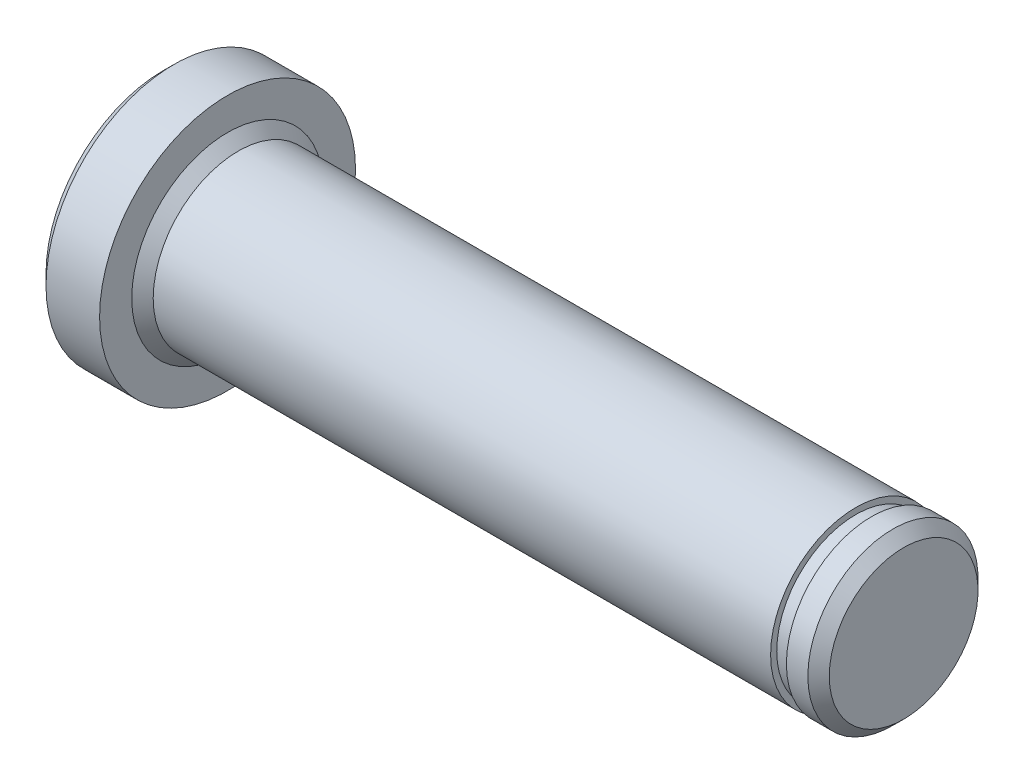
ISO-10303-21;
HEADER;
FILE_DESCRIPTION(('STEP AP214'),'2;1');
FILE_NAME('part.step','',(''),(''),'','','');
FILE_SCHEMA(('AUTOMOTIVE_DESIGN { 1 0 10303 214 1 1 1 1 }'));
ENDSEC;
DATA;
#1=APPLICATION_CONTEXT('core data for automotive mechanical design processes');
#2=APPLICATION_PROTOCOL_DEFINITION('international standard','automotive_design',2000,#1);
#3=PRODUCT_CONTEXT('',#1,'mechanical');
#4=PRODUCT('Part','Part','',(#3));
#5=PRODUCT_RELATED_PRODUCT_CATEGORY('part','',(#4));
#6=PRODUCT_DEFINITION_FORMATION('','',#4);
#7=PRODUCT_DEFINITION_CONTEXT('part definition',#1,'design');
#8=PRODUCT_DEFINITION('design','',#6,#7);
#9=PRODUCT_DEFINITION_SHAPE('','',#8);
#10=(LENGTH_UNIT() NAMED_UNIT(*) SI_UNIT(.MILLI.,.METRE.));
#11=(NAMED_UNIT(*) PLANE_ANGLE_UNIT() SI_UNIT($,.RADIAN.));
#12=(NAMED_UNIT(*) SI_UNIT($,.STERADIAN.) SOLID_ANGLE_UNIT());
#13=UNCERTAINTY_MEASURE_WITH_UNIT(LENGTH_MEASURE(1.E-05),#10,'distance_accuracy_value','');
#14=(GEOMETRIC_REPRESENTATION_CONTEXT(3) GLOBAL_UNCERTAINTY_ASSIGNED_CONTEXT((#13)) GLOBAL_UNIT_ASSIGNED_CONTEXT((#10,
#11,#12)) REPRESENTATION_CONTEXT('',''));
#15=CARTESIAN_POINT('',(0.,0.,0.));
#16=DIRECTION('',(0.,0.,1.));
#17=DIRECTION('',(1.,0.,0.));
#18=AXIS2_PLACEMENT_3D('',#15,#16,#17);
#19=CARTESIAN_POINT('',(-20.1990828492571,0.,0.));
#20=DIRECTION('',(-1.,0.,0.));
#21=DIRECTION('',(0.,0.,1.));
#22=AXIS2_PLACEMENT_3D('',#19,#20,#21);
#23=CYLINDRICAL_SURFACE('',#22,3.96875);
#24=CARTESIAN_POINT('',(0.499999999999994,0.,0.));
#25=DIRECTION('',(-1.,0.,0.));
#26=DIRECTION('',(0.,0.,1.));
#27=AXIS2_PLACEMENT_3D('',#24,#25,#26);
#28=CIRCLE('',#27,3.96875);
#29=CARTESIAN_POINT('',(0.499999999999994,0.,3.96875));
#30=VERTEX_POINT('',#29);
#31=EDGE_CURVE('E52',#30,#30,#28,.F.);
#32=ORIENTED_EDGE('',*,*,#31,.T.);
#33=EDGE_LOOP('',(#32));
#34=FACE_BOUND('',#33,.T.);
#35=CARTESIAN_POINT('',(29.3,0.,0.));
#36=DIRECTION('',(-1.,0.,0.));
#37=DIRECTION('',(0.,0.,1.));
#38=AXIS2_PLACEMENT_3D('',#35,#36,#37);
#39=CIRCLE('',#38,3.96875);
#40=CARTESIAN_POINT('',(29.3,0.,3.96875));
#41=VERTEX_POINT('',#40);
#42=EDGE_CURVE('E58',#41,#41,#39,.T.);
#43=ORIENTED_EDGE('',*,*,#42,.T.);
#44=EDGE_LOOP('',(#43));
#45=FACE_BOUND('',#44,.T.);
#46=ADVANCED_FACE('F32',(#34,#45),#23,.T.);
#47=CARTESIAN_POINT('',(29.3,3.96875000000002,0.));
#48=DIRECTION('',(-1.,0.,0.));
#49=DIRECTION('',(0.,0.,1.));
#50=AXIS2_PLACEMENT_3D('',#47,#48,#49);
#51=PLANE('',#50);
#52=ORIENTED_EDGE('',*,*,#42,.F.);
#53=EDGE_LOOP('',(#52));
#54=FACE_BOUND('',#53,.T.);
#55=CARTESIAN_POINT('',(29.3,0.,0.));
#56=DIRECTION('',(-1.,0.,0.));
#57=DIRECTION('',(0.,0.,1.));
#58=AXIS2_PLACEMENT_3D('',#55,#56,#57);
#59=CIRCLE('',#58,3.683);
#60=CARTESIAN_POINT('',(29.3,0.,3.683));
#61=VERTEX_POINT('',#60);
#62=EDGE_CURVE('E61',#61,#61,#59,.T.);
#63=ORIENTED_EDGE('',*,*,#62,.T.);
#64=EDGE_LOOP('',(#63));
#65=FACE_BOUND('',#64,.T.);
#66=ADVANCED_FACE('F92',(#54,#65),#51,.F.);
#67=CARTESIAN_POINT('',(-20.1990828492571,0.,0.));
#68=DIRECTION('',(-1.,0.,0.));
#69=DIRECTION('',(0.,0.,1.));
#70=AXIS2_PLACEMENT_3D('',#67,#68,#69);
#71=CYLINDRICAL_SURFACE('',#70,3.683);
#72=ORIENTED_EDGE('',*,*,#62,.F.);
#73=EDGE_LOOP('',(#72));
#74=FACE_BOUND('',#73,.T.);
#75=CARTESIAN_POINT('',(30.0366,0.,0.));
#76=DIRECTION('',(-1.,0.,0.));
#77=DIRECTION('',(0.,0.,1.));
#78=AXIS2_PLACEMENT_3D('',#75,#76,#77);
#79=CIRCLE('',#78,3.683);
#80=CARTESIAN_POINT('',(30.0366,0.,3.683));
#81=VERTEX_POINT('',#80);
#82=EDGE_CURVE('E64',#81,#81,#79,.T.);
#83=ORIENTED_EDGE('',*,*,#82,.T.);
#84=EDGE_LOOP('',(#83));
#85=FACE_BOUND('',#84,.T.);
#86=ADVANCED_FACE('F98',(#74,#85),#71,.T.);
#87=CARTESIAN_POINT('',(30.0366,3.68299999999999,0.));
#88=DIRECTION('',(1.,0.,0.));
#89=DIRECTION('',(0.,0.,-1.));
#90=AXIS2_PLACEMENT_3D('',#87,#88,#89);
#91=PLANE('',#90);
#92=ORIENTED_EDGE('',*,*,#82,.F.);
#93=EDGE_LOOP('',(#92));
#94=FACE_BOUND('',#93,.T.);
#95=CARTESIAN_POINT('',(30.0366,0.,0.));
#96=DIRECTION('',(-1.,0.,0.));
#97=DIRECTION('',(0.,0.,1.));
#98=AXIS2_PLACEMENT_3D('',#95,#96,#97);
#99=CIRCLE('',#98,3.96875);
#100=CARTESIAN_POINT('',(30.0366,0.,3.96875));
#101=VERTEX_POINT('',#100);
#102=EDGE_CURVE('E67',#101,#101,#99,.T.);
#103=ORIENTED_EDGE('',*,*,#102,.T.);
#104=EDGE_LOOP('',(#103));
#105=FACE_BOUND('',#104,.T.);
#106=ADVANCED_FACE('F124',(#94,#105),#91,.F.);
#107=CARTESIAN_POINT('',(-20.1990828492571,0.,0.));
#108=DIRECTION('',(-1.,0.,0.));
#109=DIRECTION('',(0.,0.,1.));
#110=AXIS2_PLACEMENT_3D('',#107,#108,#109);
#111=CYLINDRICAL_SURFACE('',#110,3.96875);
#112=CARTESIAN_POINT('',(31.0366,0.,0.));
#113=DIRECTION('',(-1.,0.,0.));
#114=DIRECTION('',(0.,0.,1.));
#115=AXIS2_PLACEMENT_3D('',#112,#113,#114);
#116=CIRCLE('',#115,3.96875);
#117=CARTESIAN_POINT('',(31.0366,0.,3.96875));
#118=VERTEX_POINT('',#117);
#119=EDGE_CURVE('E39',#118,#118,#116,.T.);
#120=ORIENTED_EDGE('',*,*,#119,.T.);
#121=EDGE_LOOP('',(#120));
#122=FACE_BOUND('',#121,.T.);
#123=ORIENTED_EDGE('',*,*,#102,.F.);
#124=EDGE_LOOP('',(#123));
#125=FACE_BOUND('',#124,.T.);
#126=ADVANCED_FACE('F119',(#122,#125),#111,.T.);
#127=CARTESIAN_POINT('',(31.5366,3.96875000000002,0.));
#128=DIRECTION('',(-1.,0.,0.));
#129=DIRECTION('',(0.,0.,1.));
#130=AXIS2_PLACEMENT_3D('',#127,#128,#129);
#131=PLANE('',#130);
#132=CARTESIAN_POINT('',(31.5366,0.,0.));
#133=DIRECTION('',(-1.,0.,0.));
#134=DIRECTION('',(0.,0.,1.));
#135=AXIS2_PLACEMENT_3D('',#132,#133,#134);
#136=CIRCLE('',#135,3.46874999999999);
#137=CARTESIAN_POINT('',(31.5366,0.,3.46874999999999));
#138=VERTEX_POINT('',#137);
#139=EDGE_CURVE('E10',#138,#138,#136,.F.);
#140=ORIENTED_EDGE('',*,*,#139,.T.);
#141=EDGE_LOOP('',(#140));
#142=FACE_BOUND('',#141,.T.);
#143=ADVANCED_FACE('F114',(#142),#131,.F.);
#144=CARTESIAN_POINT('',(-3.,5.96874999999997,0.));
#145=DIRECTION('',(1.,0.,0.));
#146=DIRECTION('',(0.,0.,-1.));
#147=AXIS2_PLACEMENT_3D('',#144,#145,#146);
#148=PLANE('',#147);
#149=CARTESIAN_POINT('',(-3.,0.,0.));
#150=DIRECTION('',(1.,0.,0.));
#151=DIRECTION('',(0.,0.,-1.));
#152=AXIS2_PLACEMENT_3D('',#149,#150,#151);
#153=CIRCLE('',#152,5.46875000000001);
#154=CARTESIAN_POINT('',(-3.,0.,-5.46875000000001));
#155=VERTEX_POINT('',#154);
#156=EDGE_CURVE('E47',#155,#155,#153,.F.);
#157=ORIENTED_EDGE('',*,*,#156,.T.);
#158=EDGE_LOOP('',(#157));
#159=FACE_BOUND('',#158,.T.);
#160=ADVANCED_FACE('F88',(#159),#148,.F.);
#161=CARTESIAN_POINT('',(-20.1990828492571,0.,0.));
#162=DIRECTION('',(-1.,0.,0.));
#163=DIRECTION('',(0.,0.,1.));
#164=AXIS2_PLACEMENT_3D('',#161,#162,#163);
#165=CYLINDRICAL_SURFACE('',#164,5.96875);
#166=CARTESIAN_POINT('',(-2.5,0.,0.));
#167=DIRECTION('',(1.,0.,0.));
#168=DIRECTION('',(0.,0.,-1.));
#169=AXIS2_PLACEMENT_3D('',#166,#167,#168);
#170=CIRCLE('',#169,5.96875);
#171=CARTESIAN_POINT('',(-2.5,0.,-5.96875000000001));
#172=VERTEX_POINT('',#171);
#173=EDGE_CURVE('E43',#172,#172,#170,.T.);
#174=ORIENTED_EDGE('',*,*,#173,.T.);
#175=EDGE_LOOP('',(#174));
#176=FACE_BOUND('',#175,.T.);
#177=CARTESIAN_POINT('',(0.,0.,0.));
#178=DIRECTION('',(-1.,0.,0.));
#179=DIRECTION('',(0.,0.,1.));
#180=AXIS2_PLACEMENT_3D('',#177,#178,#179);
#181=CIRCLE('',#180,5.96875);
#182=CARTESIAN_POINT('',(0.,0.,5.96875000000001));
#183=VERTEX_POINT('',#182);
#184=EDGE_CURVE('E70',#183,#183,#181,.T.);
#185=ORIENTED_EDGE('',*,*,#184,.T.);
#186=EDGE_LOOP('',(#185));
#187=FACE_BOUND('',#186,.T.);
#188=ADVANCED_FACE('F74',(#176,#187),#165,.T.);
#189=CARTESIAN_POINT('',(0.,3.96875000000002,0.));
#190=DIRECTION('',(-1.,0.,0.));
#191=DIRECTION('',(0.,0.,1.));
#192=AXIS2_PLACEMENT_3D('',#189,#190,#191);
#193=PLANE('',#192);
#194=CARTESIAN_POINT('',(0.,0.,0.));
#195=DIRECTION('',(-1.,0.,0.));
#196=DIRECTION('',(0.,0.,1.));
#197=AXIS2_PLACEMENT_3D('',#194,#195,#196);
#198=CIRCLE('',#197,4.46875);
#199=CARTESIAN_POINT('',(0.,0.,4.46875));
#200=VERTEX_POINT('',#199);
#201=EDGE_CURVE('E55',#200,#200,#198,.T.);
#202=ORIENTED_EDGE('',*,*,#201,.T.);
#203=EDGE_LOOP('',(#202));
#204=FACE_BOUND('',#203,.T.);
#205=ORIENTED_EDGE('',*,*,#184,.F.);
#206=EDGE_LOOP('',(#205));
#207=FACE_BOUND('',#206,.T.);
#208=ADVANCED_FACE('F76',(#204,#207),#193,.F.);
#209=CARTESIAN_POINT('',(0.,0.,0.));
#210=DIRECTION('',(-1.,0.,0.));
#211=DIRECTION('',(0.,0.,1.));
#212=AXIS2_PLACEMENT_3D('',#209,#210,#211);
#213=CONICAL_SURFACE('',#212,4.46875,0.785398163397455);
#214=ORIENTED_EDGE('',*,*,#31,.F.);
#215=EDGE_LOOP('',(#214));
#216=FACE_BOUND('',#215,.T.);
#217=ORIENTED_EDGE('',*,*,#201,.F.);
#218=EDGE_LOOP('',(#217));
#219=FACE_BOUND('',#218,.T.);
#220=ADVANCED_FACE('F78',(#216,#219),#213,.T.);
#221=CARTESIAN_POINT('',(-3.,0.,0.));
#222=DIRECTION('',(1.,0.,0.));
#223=DIRECTION('',(0.,0.,-1.));
#224=AXIS2_PLACEMENT_3D('',#221,#222,#223);
#225=CONICAL_SURFACE('',#224,5.46875000000001,0.785398163397442);
#226=ORIENTED_EDGE('',*,*,#173,.F.);
#227=EDGE_LOOP('',(#226));
#228=FACE_BOUND('',#227,.T.);
#229=ORIENTED_EDGE('',*,*,#156,.F.);
#230=EDGE_LOOP('',(#229));
#231=FACE_BOUND('',#230,.T.);
#232=ADVANCED_FACE('F85',(#228,#231),#225,.T.);
#233=CARTESIAN_POINT('',(31.0366,0.,0.));
#234=DIRECTION('',(-1.,0.,0.));
#235=DIRECTION('',(0.,0.,1.));
#236=AXIS2_PLACEMENT_3D('',#233,#234,#235);
#237=CONICAL_SURFACE('',#236,3.96875,0.785398163397452);
#238=ORIENTED_EDGE('',*,*,#139,.F.);
#239=EDGE_LOOP('',(#238));
#240=FACE_BOUND('',#239,.T.);
#241=ORIENTED_EDGE('',*,*,#119,.F.);
#242=EDGE_LOOP('',(#241));
#243=FACE_BOUND('',#242,.T.);
#244=ADVANCED_FACE('F34',(#240,#243),#237,.T.);
#245=CLOSED_SHELL('',(#46,#66,#86,#106,#126,#143,#160,#188,#208,#220,#232,#244));
#246=MANIFOLD_SOLID_BREP('B2',#245);
#247=ADVANCED_BREP_SHAPE_REPRESENTATION('',(#18,#246),#14);
#248=SHAPE_DEFINITION_REPRESENTATION(#9,#247);
ENDSEC;
END-ISO-10303-21;
